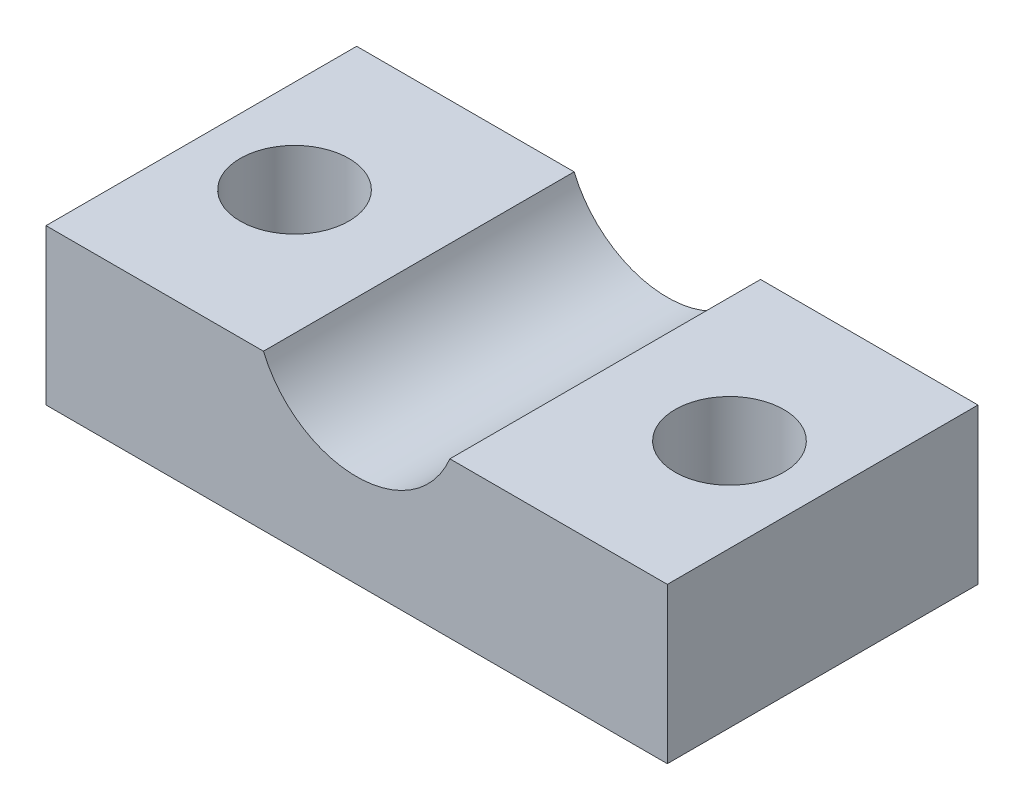
ISO-10303-21;
HEADER;
FILE_DESCRIPTION(('STEP AP214'),'2;1');
FILE_NAME('part.step','',(''),(''),'','','');
FILE_SCHEMA(('AUTOMOTIVE_DESIGN { 1 0 10303 214 1 1 1 1 }'));
ENDSEC;
DATA;
#1=APPLICATION_CONTEXT('core data for automotive mechanical design processes');
#2=APPLICATION_PROTOCOL_DEFINITION('international standard','automotive_design',2000,#1);
#3=PRODUCT_CONTEXT('',#1,'mechanical');
#4=PRODUCT('Part','Part','',(#3));
#5=PRODUCT_RELATED_PRODUCT_CATEGORY('part','',(#4));
#6=PRODUCT_DEFINITION_FORMATION('','',#4);
#7=PRODUCT_DEFINITION_CONTEXT('part definition',#1,'design');
#8=PRODUCT_DEFINITION('design','',#6,#7);
#9=PRODUCT_DEFINITION_SHAPE('','',#8);
#10=(LENGTH_UNIT() NAMED_UNIT(*) SI_UNIT(.MILLI.,.METRE.));
#11=(NAMED_UNIT(*) PLANE_ANGLE_UNIT() SI_UNIT($,.RADIAN.));
#12=(NAMED_UNIT(*) SI_UNIT($,.STERADIAN.) SOLID_ANGLE_UNIT());
#13=UNCERTAINTY_MEASURE_WITH_UNIT(LENGTH_MEASURE(1.E-05),#10,'distance_accuracy_value','');
#14=(GEOMETRIC_REPRESENTATION_CONTEXT(3) GLOBAL_UNCERTAINTY_ASSIGNED_CONTEXT((#13)) GLOBAL_UNIT_ASSIGNED_CONTEXT((#10,
#11,#12)) REPRESENTATION_CONTEXT('',''));
#15=CARTESIAN_POINT('',(0.,0.,0.));
#16=DIRECTION('',(0.,0.,1.));
#17=DIRECTION('',(1.,0.,0.));
#18=AXIS2_PLACEMENT_3D('',#15,#16,#17);
#19=CARTESIAN_POINT('',(0.,0.,10.));
#20=DIRECTION('',(1.,0.,0.));
#21=DIRECTION('',(0.,1.,0.));
#22=AXIS2_PLACEMENT_3D('',#19,#20,#21);
#23=PLANE('',#22);
#24=DIRECTION('',(0.,-1.,0.));
#25=VECTOR('',#24,1.);
#26=CARTESIAN_POINT('',(0.,0.,0.));
#27=LINE('',#26,#25);
#28=CARTESIAN_POINT('',(0.,5.,0.));
#29=VERTEX_POINT('',#28);
#30=CARTESIAN_POINT('',(0.,0.,0.));
#31=VERTEX_POINT('',#30);
#32=EDGE_CURVE('E117',#29,#31,#27,.T.);
#33=ORIENTED_EDGE('',*,*,#32,.T.);
#34=DIRECTION('',(0.,0.,-1.));
#35=VECTOR('',#34,1.);
#36=CARTESIAN_POINT('',(0.,0.,10.));
#37=LINE('',#36,#35);
#38=CARTESIAN_POINT('',(0.,0.,10.));
#39=VERTEX_POINT('',#38);
#40=EDGE_CURVE('E11',#39,#31,#37,.T.);
#41=ORIENTED_EDGE('',*,*,#40,.F.);
#42=DIRECTION('',(0.,-1.,0.));
#43=VECTOR('',#42,1.);
#44=CARTESIAN_POINT('',(0.,0.,10.));
#45=LINE('',#44,#43);
#46=CARTESIAN_POINT('',(0.,5.,10.));
#47=VERTEX_POINT('',#46);
#48=EDGE_CURVE('E128',#47,#39,#45,.T.);
#49=ORIENTED_EDGE('',*,*,#48,.F.);
#50=DIRECTION('',(0.,0.,-1.));
#51=VECTOR('',#50,1.);
#52=CARTESIAN_POINT('',(0.,5.,10.));
#53=LINE('',#52,#51);
#54=EDGE_CURVE('E113',#47,#29,#53,.T.);
#55=ORIENTED_EDGE('',*,*,#54,.T.);
#56=EDGE_LOOP('',(#33,#41,#49,#55));
#57=FACE_BOUND('',#56,.T.);
#58=ADVANCED_FACE('F33',(#57),#23,.F.);
#59=CARTESIAN_POINT('',(0.,0.,10.));
#60=DIRECTION('',(0.,1.,0.));
#61=DIRECTION('',(0.,0.,1.));
#62=AXIS2_PLACEMENT_3D('',#59,#60,#61);
#63=PLANE('',#62);
#64=CARTESIAN_POINT('',(17.,0.,5.));
#65=DIRECTION('',(0.,1.,0.));
#66=DIRECTION('',(0.,0.,1.));
#67=AXIS2_PLACEMENT_3D('',#64,#65,#66);
#68=CIRCLE('',#67,1.75);
#69=CARTESIAN_POINT('',(17.,0.,6.75));
#70=VERTEX_POINT('',#69);
#71=EDGE_CURVE('E174',#70,#70,#68,.T.);
#72=ORIENTED_EDGE('',*,*,#71,.T.);
#73=EDGE_LOOP('',(#72));
#74=FACE_BOUND('',#73,.T.);
#75=CARTESIAN_POINT('',(3.,0.,5.));
#76=DIRECTION('',(0.,1.,0.));
#77=DIRECTION('',(0.,0.,1.));
#78=AXIS2_PLACEMENT_3D('',#75,#76,#77);
#79=CIRCLE('',#78,1.75);
#80=CARTESIAN_POINT('',(3.,0.,6.75));
#81=VERTEX_POINT('',#80);
#82=EDGE_CURVE('E121',#81,#81,#79,.T.);
#83=ORIENTED_EDGE('',*,*,#82,.T.);
#84=EDGE_LOOP('',(#83));
#85=FACE_BOUND('',#84,.T.);
#86=DIRECTION('',(1.,0.,0.));
#87=VECTOR('',#86,1.);
#88=CARTESIAN_POINT('',(0.,0.,0.));
#89=LINE('',#88,#87);
#90=CARTESIAN_POINT('',(20.,0.,0.));
#91=VERTEX_POINT('',#90);
#92=EDGE_CURVE('E120',#31,#91,#89,.T.);
#93=ORIENTED_EDGE('',*,*,#92,.T.);
#94=DIRECTION('',(0.,0.,-1.));
#95=VECTOR('',#94,1.);
#96=CARTESIAN_POINT('',(20.,0.,10.));
#97=LINE('',#96,#95);
#98=CARTESIAN_POINT('',(20.,0.,10.));
#99=VERTEX_POINT('',#98);
#100=EDGE_CURVE('E41',#99,#91,#97,.T.);
#101=ORIENTED_EDGE('',*,*,#100,.F.);
#102=DIRECTION('',(1.,0.,0.));
#103=VECTOR('',#102,1.);
#104=CARTESIAN_POINT('',(0.,0.,10.));
#105=LINE('',#104,#103);
#106=EDGE_CURVE('E86',#39,#99,#105,.T.);
#107=ORIENTED_EDGE('',*,*,#106,.F.);
#108=ORIENTED_EDGE('',*,*,#40,.T.);
#109=EDGE_LOOP('',(#93,#101,#107,#108));
#110=FACE_BOUND('',#109,.T.);
#111=ADVANCED_FACE('F154',(#74,#85,#110),#63,.F.);
#112=CARTESIAN_POINT('',(20.,0.,10.));
#113=DIRECTION('',(-1.,0.,0.));
#114=DIRECTION('',(0.,0.,1.));
#115=AXIS2_PLACEMENT_3D('',#112,#113,#114);
#116=PLANE('',#115);
#117=DIRECTION('',(0.,1.,0.));
#118=VECTOR('',#117,1.);
#119=CARTESIAN_POINT('',(20.,0.,0.));
#120=LINE('',#119,#118);
#121=CARTESIAN_POINT('',(20.,5.,0.));
#122=VERTEX_POINT('',#121);
#123=EDGE_CURVE('E123',#91,#122,#120,.T.);
#124=ORIENTED_EDGE('',*,*,#123,.T.);
#125=DIRECTION('',(0.,0.,-1.));
#126=VECTOR('',#125,1.);
#127=CARTESIAN_POINT('',(20.,5.,10.));
#128=LINE('',#127,#126);
#129=CARTESIAN_POINT('',(20.,5.,10.));
#130=VERTEX_POINT('',#129);
#131=EDGE_CURVE('E108',#130,#122,#128,.T.);
#132=ORIENTED_EDGE('',*,*,#131,.F.);
#133=DIRECTION('',(0.,1.,0.));
#134=VECTOR('',#133,1.);
#135=CARTESIAN_POINT('',(20.,0.,10.));
#136=LINE('',#135,#134);
#137=EDGE_CURVE('E99',#99,#130,#136,.T.);
#138=ORIENTED_EDGE('',*,*,#137,.F.);
#139=ORIENTED_EDGE('',*,*,#100,.T.);
#140=EDGE_LOOP('',(#124,#132,#138,#139));
#141=FACE_BOUND('',#140,.T.);
#142=ADVANCED_FACE('F134',(#141),#116,.F.);
#143=CARTESIAN_POINT('',(20.,5.,10.));
#144=DIRECTION('',(0.,-1.,0.));
#145=DIRECTION('',(0.,0.,-1.));
#146=AXIS2_PLACEMENT_3D('',#143,#144,#145);
#147=PLANE('',#146);
#148=CARTESIAN_POINT('',(17.,5.,5.));
#149=DIRECTION('',(0.,1.,0.));
#150=DIRECTION('',(0.,0.,1.));
#151=AXIS2_PLACEMENT_3D('',#148,#149,#150);
#152=CIRCLE('',#151,1.75);
#153=CARTESIAN_POINT('',(17.,5.,6.75));
#154=VERTEX_POINT('',#153);
#155=EDGE_CURVE('E172',#154,#154,#152,.T.);
#156=ORIENTED_EDGE('',*,*,#155,.F.);
#157=EDGE_LOOP('',(#156));
#158=FACE_BOUND('',#157,.T.);
#159=DIRECTION('',(-1.,0.,0.));
#160=VECTOR('',#159,1.);
#161=CARTESIAN_POINT('',(20.,5.,0.));
#162=LINE('',#161,#160);
#163=CARTESIAN_POINT('',(13.,5.,0.));
#164=VERTEX_POINT('',#163);
#165=EDGE_CURVE('E107',#122,#164,#162,.T.);
#166=ORIENTED_EDGE('',*,*,#165,.T.);
#167=DIRECTION('',(0.,0.,-1.));
#168=VECTOR('',#167,1.);
#169=CARTESIAN_POINT('',(13.,5.,10.));
#170=LINE('',#169,#168);
#171=CARTESIAN_POINT('',(13.,5.,10.));
#172=VERTEX_POINT('',#171);
#173=EDGE_CURVE('E104',#172,#164,#170,.T.);
#174=ORIENTED_EDGE('',*,*,#173,.F.);
#175=DIRECTION('',(-1.,0.,0.));
#176=VECTOR('',#175,1.);
#177=CARTESIAN_POINT('',(20.,5.,10.));
#178=LINE('',#177,#176);
#179=EDGE_CURVE('E93',#130,#172,#178,.T.);
#180=ORIENTED_EDGE('',*,*,#179,.F.);
#181=ORIENTED_EDGE('',*,*,#131,.T.);
#182=EDGE_LOOP('',(#166,#174,#180,#181));
#183=FACE_BOUND('',#182,.T.);
#184=ADVANCED_FACE('F105',(#158,#183),#147,.F.);
#185=CARTESIAN_POINT('',(10.,6.25,10.));
#186=DIRECTION('',(0.,0.,-1.));
#187=DIRECTION('',(-1.,0.,0.));
#188=AXIS2_PLACEMENT_3D('',#185,#186,#187);
#189=CYLINDRICAL_SURFACE('',#188,3.25);
#190=CARTESIAN_POINT('',(10.,6.25,0.));
#191=DIRECTION('',(0.,0.,-1.));
#192=DIRECTION('',(1.,0.,0.));
#193=AXIS2_PLACEMENT_3D('',#190,#191,#192);
#194=CIRCLE('',#193,3.25);
#195=CARTESIAN_POINT('',(7.,5.,0.));
#196=VERTEX_POINT('',#195);
#197=EDGE_CURVE('E72',#164,#196,#194,.T.);
#198=ORIENTED_EDGE('',*,*,#197,.T.);
#199=DIRECTION('',(0.,0.,-1.));
#200=VECTOR('',#199,1.);
#201=CARTESIAN_POINT('',(7.,5.,10.));
#202=LINE('',#201,#200);
#203=CARTESIAN_POINT('',(7.,5.,10.));
#204=VERTEX_POINT('',#203);
#205=EDGE_CURVE('E109',#204,#196,#202,.T.);
#206=ORIENTED_EDGE('',*,*,#205,.F.);
#207=CARTESIAN_POINT('',(10.,6.25,10.));
#208=DIRECTION('',(0.,0.,-1.));
#209=DIRECTION('',(1.,0.,0.));
#210=AXIS2_PLACEMENT_3D('',#207,#208,#209);
#211=CIRCLE('',#210,3.25);
#212=EDGE_CURVE('E97',#172,#204,#211,.T.);
#213=ORIENTED_EDGE('',*,*,#212,.F.);
#214=ORIENTED_EDGE('',*,*,#173,.T.);
#215=EDGE_LOOP('',(#198,#206,#213,#214));
#216=FACE_BOUND('',#215,.T.);
#217=ADVANCED_FACE('F111',(#216),#189,.F.);
#218=CARTESIAN_POINT('',(0.,5.,10.));
#219=DIRECTION('',(0.,-1.,0.));
#220=DIRECTION('',(0.,0.,-1.));
#221=AXIS2_PLACEMENT_3D('',#218,#219,#220);
#222=PLANE('',#221);
#223=CARTESIAN_POINT('',(3.,5.,5.));
#224=DIRECTION('',(0.,1.,0.));
#225=DIRECTION('',(0.,0.,1.));
#226=AXIS2_PLACEMENT_3D('',#223,#224,#225);
#227=CIRCLE('',#226,1.75);
#228=CARTESIAN_POINT('',(3.,5.,6.75));
#229=VERTEX_POINT('',#228);
#230=EDGE_CURVE('E176',#229,#229,#227,.T.);
#231=ORIENTED_EDGE('',*,*,#230,.F.);
#232=EDGE_LOOP('',(#231));
#233=FACE_BOUND('',#232,.T.);
#234=DIRECTION('',(-1.,0.,0.));
#235=VECTOR('',#234,1.);
#236=CARTESIAN_POINT('',(0.,5.,0.));
#237=LINE('',#236,#235);
#238=EDGE_CURVE('E78',#196,#29,#237,.T.);
#239=ORIENTED_EDGE('',*,*,#238,.T.);
#240=ORIENTED_EDGE('',*,*,#54,.F.);
#241=DIRECTION('',(-1.,0.,0.));
#242=VECTOR('',#241,1.);
#243=CARTESIAN_POINT('',(0.,5.,10.));
#244=LINE('',#243,#242);
#245=EDGE_CURVE('E49',#204,#47,#244,.T.);
#246=ORIENTED_EDGE('',*,*,#245,.F.);
#247=ORIENTED_EDGE('',*,*,#205,.T.);
#248=EDGE_LOOP('',(#239,#240,#246,#247));
#249=FACE_BOUND('',#248,.T.);
#250=ADVANCED_FACE('F141',(#233,#249),#222,.F.);
#251=CARTESIAN_POINT('',(10.,6.25,10.));
#252=DIRECTION('',(0.,0.,1.));
#253=DIRECTION('',(1.,0.,0.));
#254=AXIS2_PLACEMENT_3D('',#251,#252,#253);
#255=PLANE('',#254);
#256=ORIENTED_EDGE('',*,*,#48,.T.);
#257=ORIENTED_EDGE('',*,*,#106,.T.);
#258=ORIENTED_EDGE('',*,*,#137,.T.);
#259=ORIENTED_EDGE('',*,*,#179,.T.);
#260=ORIENTED_EDGE('',*,*,#212,.T.);
#261=ORIENTED_EDGE('',*,*,#245,.T.);
#262=EDGE_LOOP('',(#256,#257,#258,#259,#260,#261));
#263=FACE_BOUND('',#262,.T.);
#264=ADVANCED_FACE('F95',(#263),#255,.T.);
#265=CARTESIAN_POINT('',(10.,6.25,0.));
#266=DIRECTION('',(0.,0.,1.));
#267=DIRECTION('',(1.,0.,0.));
#268=AXIS2_PLACEMENT_3D('',#265,#266,#267);
#269=PLANE('',#268);
#270=ORIENTED_EDGE('',*,*,#32,.F.);
#271=ORIENTED_EDGE('',*,*,#238,.F.);
#272=ORIENTED_EDGE('',*,*,#197,.F.);
#273=ORIENTED_EDGE('',*,*,#165,.F.);
#274=ORIENTED_EDGE('',*,*,#123,.F.);
#275=ORIENTED_EDGE('',*,*,#92,.F.);
#276=EDGE_LOOP('',(#270,#271,#272,#273,#274,#275));
#277=FACE_BOUND('',#276,.T.);
#278=ADVANCED_FACE('F137',(#277),#269,.F.);
#279=CARTESIAN_POINT('',(3.,0.,5.));
#280=DIRECTION('',(0.,1.,0.));
#281=DIRECTION('',(0.,0.,1.));
#282=AXIS2_PLACEMENT_3D('',#279,#280,#281);
#283=CYLINDRICAL_SURFACE('',#282,1.75);
#284=ORIENTED_EDGE('',*,*,#82,.F.);
#285=EDGE_LOOP('',(#284));
#286=FACE_BOUND('',#285,.T.);
#287=ORIENTED_EDGE('',*,*,#230,.T.);
#288=EDGE_LOOP('',(#287));
#289=FACE_BOUND('',#288,.T.);
#290=ADVANCED_FACE('F185',(#286,#289),#283,.F.);
#291=CARTESIAN_POINT('',(17.,0.,5.));
#292=DIRECTION('',(0.,1.,0.));
#293=DIRECTION('',(0.,0.,1.));
#294=AXIS2_PLACEMENT_3D('',#291,#292,#293);
#295=CYLINDRICAL_SURFACE('',#294,1.75);
#296=ORIENTED_EDGE('',*,*,#71,.F.);
#297=EDGE_LOOP('',(#296));
#298=FACE_BOUND('',#297,.T.);
#299=ORIENTED_EDGE('',*,*,#155,.T.);
#300=EDGE_LOOP('',(#299));
#301=FACE_BOUND('',#300,.T.);
#302=ADVANCED_FACE('F187',(#298,#301),#295,.F.);
#303=CLOSED_SHELL('',(#58,#111,#142,#184,#217,#250,#264,#278,#290,#302));
#304=MANIFOLD_SOLID_BREP('B2',#303);
#305=ADVANCED_BREP_SHAPE_REPRESENTATION('',(#18,#304),#14);
#306=SHAPE_DEFINITION_REPRESENTATION(#9,#305);
ENDSEC;
END-ISO-10303-21;
